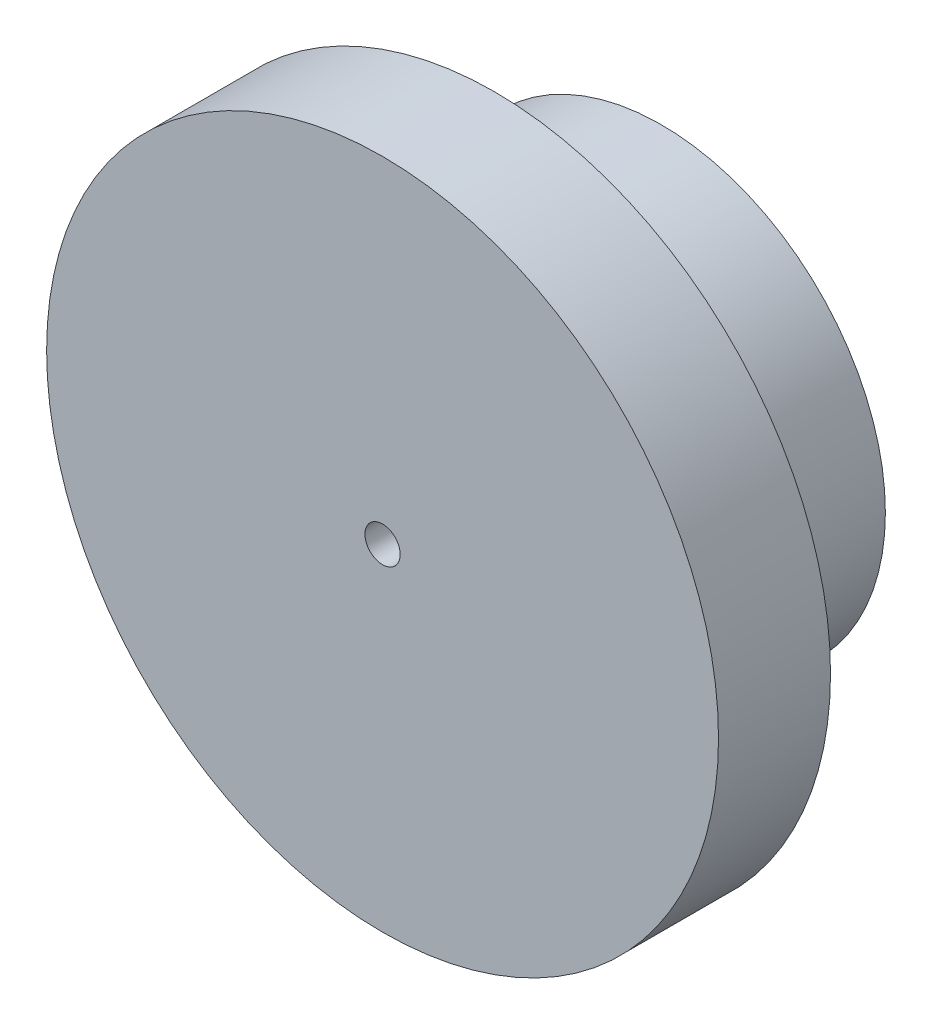
ISO-10303-21;
HEADER;
FILE_DESCRIPTION(('STEP AP214'),'2;1');
FILE_NAME('part.step','',(''),(''),'','','');
FILE_SCHEMA(('AUTOMOTIVE_DESIGN { 1 0 10303 214 1 1 1 1 }'));
ENDSEC;
DATA;
#1=APPLICATION_CONTEXT('core data for automotive mechanical design processes');
#2=APPLICATION_PROTOCOL_DEFINITION('international standard','automotive_design',2000,#1);
#3=PRODUCT_CONTEXT('',#1,'mechanical');
#4=PRODUCT('Part','Part','',(#3));
#5=PRODUCT_RELATED_PRODUCT_CATEGORY('part','',(#4));
#6=PRODUCT_DEFINITION_FORMATION('','',#4);
#7=PRODUCT_DEFINITION_CONTEXT('part definition',#1,'design');
#8=PRODUCT_DEFINITION('design','',#6,#7);
#9=PRODUCT_DEFINITION_SHAPE('','',#8);
#10=(LENGTH_UNIT() NAMED_UNIT(*) SI_UNIT(.MILLI.,.METRE.));
#11=(NAMED_UNIT(*) PLANE_ANGLE_UNIT() SI_UNIT($,.RADIAN.));
#12=(NAMED_UNIT(*) SI_UNIT($,.STERADIAN.) SOLID_ANGLE_UNIT());
#13=UNCERTAINTY_MEASURE_WITH_UNIT(LENGTH_MEASURE(1.E-05),#10,'distance_accuracy_value','');
#14=(GEOMETRIC_REPRESENTATION_CONTEXT(3) GLOBAL_UNCERTAINTY_ASSIGNED_CONTEXT((#13)) GLOBAL_UNIT_ASSIGNED_CONTEXT((#10,
#11,#12)) REPRESENTATION_CONTEXT('',''));
#15=CARTESIAN_POINT('',(0.,0.,0.));
#16=DIRECTION('',(0.,0.,1.));
#17=DIRECTION('',(1.,0.,0.));
#18=AXIS2_PLACEMENT_3D('',#15,#16,#17);
#19=CARTESIAN_POINT('',(0.,0.,-3.11150000000002));
#20=DIRECTION('',(0.,0.,1.));
#21=DIRECTION('',(1.,0.,0.));
#22=AXIS2_PLACEMENT_3D('',#19,#20,#21);
#23=CYLINDRICAL_SURFACE('',#22,12.7);
#24=CARTESIAN_POINT('',(0.,0.,-3.11150000000002));
#25=DIRECTION('',(0.,0.,1.));
#26=DIRECTION('',(1.,0.,0.));
#27=AXIS2_PLACEMENT_3D('',#24,#25,#26);
#28=CIRCLE('',#27,12.7);
#29=CARTESIAN_POINT('',(12.7,0.,-3.11150000000002));
#30=VERTEX_POINT('',#29);
#31=EDGE_CURVE('E10',#30,#30,#28,.T.);
#32=ORIENTED_EDGE('',*,*,#31,.T.);
#33=EDGE_LOOP('',(#32));
#34=FACE_BOUND('',#33,.T.);
#35=CARTESIAN_POINT('',(0.,0.,6.35));
#36=DIRECTION('',(0.,0.,1.));
#37=DIRECTION('',(1.,0.,0.));
#38=AXIS2_PLACEMENT_3D('',#35,#36,#37);
#39=CIRCLE('',#38,12.7);
#40=CARTESIAN_POINT('',(12.7,0.,6.35));
#41=VERTEX_POINT('',#40);
#42=EDGE_CURVE('E38',#41,#41,#39,.T.);
#43=ORIENTED_EDGE('',*,*,#42,.F.);
#44=EDGE_LOOP('',(#43));
#45=FACE_BOUND('',#44,.T.);
#46=ADVANCED_FACE('F32',(#34,#45),#23,.T.);
#47=CARTESIAN_POINT('',(0.,0.,-3.11150000000002));
#48=DIRECTION('',(0.,0.,1.));
#49=DIRECTION('',(1.,0.,0.));
#50=AXIS2_PLACEMENT_3D('',#47,#48,#49);
#51=PLANE('',#50);
#52=CARTESIAN_POINT('',(0.,0.,-3.11150000000002));
#53=DIRECTION('',(0.,0.,-1.));
#54=DIRECTION('',(-1.,0.,0.));
#55=AXIS2_PLACEMENT_3D('',#52,#53,#54);
#56=CIRCLE('',#55,11.);
#57=CARTESIAN_POINT('',(-11.,0.,-3.11150000000002));
#58=VERTEX_POINT('',#57);
#59=EDGE_CURVE('E58',#58,#58,#56,.T.);
#60=ORIENTED_EDGE('',*,*,#59,.F.);
#61=EDGE_LOOP('',(#60));
#62=FACE_BOUND('',#61,.T.);
#63=ORIENTED_EDGE('',*,*,#31,.F.);
#64=EDGE_LOOP('',(#63));
#65=FACE_BOUND('',#64,.T.);
#66=ADVANCED_FACE('F73',(#62,#65),#51,.F.);
#67=CARTESIAN_POINT('',(0.,0.,6.35));
#68=DIRECTION('',(0.,0.,1.));
#69=DIRECTION('',(1.,0.,0.));
#70=AXIS2_PLACEMENT_3D('',#67,#68,#69);
#71=PLANE('',#70);
#72=CARTESIAN_POINT('',(0.,0.,6.35));
#73=DIRECTION('',(0.,0.,1.));
#74=DIRECTION('',(1.,0.,0.));
#75=AXIS2_PLACEMENT_3D('',#72,#73,#74);
#76=CIRCLE('',#75,19.05);
#77=CARTESIAN_POINT('',(19.05,0.,6.35));
#78=VERTEX_POINT('',#77);
#79=EDGE_CURVE('E46',#78,#78,#76,.T.);
#80=ORIENTED_EDGE('',*,*,#79,.F.);
#81=EDGE_LOOP('',(#80));
#82=FACE_BOUND('',#81,.T.);
#83=ORIENTED_EDGE('',*,*,#42,.T.);
#84=EDGE_LOOP('',(#83));
#85=FACE_BOUND('',#84,.T.);
#86=ADVANCED_FACE('F76',(#82,#85),#71,.F.);
#87=CARTESIAN_POINT('',(0.,0.,12.7));
#88=DIRECTION('',(0.,0.,1.));
#89=DIRECTION('',(1.,0.,0.));
#90=AXIS2_PLACEMENT_3D('',#87,#88,#89);
#91=PLANE('',#90);
#92=CARTESIAN_POINT('',(0.,0.,12.7));
#93=DIRECTION('',(0.,0.,1.));
#94=DIRECTION('',(1.,0.,0.));
#95=AXIS2_PLACEMENT_3D('',#92,#93,#94);
#96=CIRCLE('',#95,19.05);
#97=CARTESIAN_POINT('',(19.05,0.,12.7));
#98=VERTEX_POINT('',#97);
#99=EDGE_CURVE('E42',#98,#98,#96,.T.);
#100=ORIENTED_EDGE('',*,*,#99,.T.);
#101=EDGE_LOOP('',(#100));
#102=FACE_BOUND('',#101,.T.);
#103=CARTESIAN_POINT('',(0.,0.,12.7));
#104=DIRECTION('',(0.,0.,1.));
#105=DIRECTION('',(1.,0.,0.));
#106=AXIS2_PLACEMENT_3D('',#103,#104,#105);
#107=CIRCLE('',#106,1.);
#108=CARTESIAN_POINT('',(1.,0.,12.7));
#109=VERTEX_POINT('',#108);
#110=EDGE_CURVE('E50',#109,#109,#107,.T.);
#111=ORIENTED_EDGE('',*,*,#110,.F.);
#112=EDGE_LOOP('',(#111));
#113=FACE_BOUND('',#112,.T.);
#114=ADVANCED_FACE('F81',(#102,#113),#91,.T.);
#115=CARTESIAN_POINT('',(0.,0.,12.7));
#116=DIRECTION('',(0.,0.,-1.));
#117=DIRECTION('',(-1.,0.,0.));
#118=AXIS2_PLACEMENT_3D('',#115,#116,#117);
#119=CYLINDRICAL_SURFACE('',#118,19.05);
#120=ORIENTED_EDGE('',*,*,#99,.F.);
#121=EDGE_LOOP('',(#120));
#122=FACE_BOUND('',#121,.T.);
#123=ORIENTED_EDGE('',*,*,#79,.T.);
#124=EDGE_LOOP('',(#123));
#125=FACE_BOUND('',#124,.T.);
#126=ADVANCED_FACE('F89',(#122,#125),#119,.T.);
#127=CARTESIAN_POINT('',(0.,0.,12.7));
#128=DIRECTION('',(0.,0.,-1.));
#129=DIRECTION('',(-1.,0.,0.));
#130=AXIS2_PLACEMENT_3D('',#127,#128,#129);
#131=CYLINDRICAL_SURFACE('',#130,1.);
#132=ORIENTED_EDGE('',*,*,#110,.T.);
#133=EDGE_LOOP('',(#132));
#134=FACE_BOUND('',#133,.T.);
#135=CARTESIAN_POINT('',(0.,0.,6.35));
#136=DIRECTION('',(0.,0.,1.));
#137=DIRECTION('',(1.,0.,0.));
#138=AXIS2_PLACEMENT_3D('',#135,#136,#137);
#139=CIRCLE('',#138,1.);
#140=CARTESIAN_POINT('',(1.,0.,6.35));
#141=VERTEX_POINT('',#140);
#142=EDGE_CURVE('E52',#141,#141,#139,.T.);
#143=ORIENTED_EDGE('',*,*,#142,.F.);
#144=EDGE_LOOP('',(#143));
#145=FACE_BOUND('',#144,.T.);
#146=ADVANCED_FACE('F87',(#134,#145),#131,.F.);
#147=CARTESIAN_POINT('',(0.,0.,6.35));
#148=DIRECTION('',(0.,0.,1.));
#149=DIRECTION('',(1.,0.,0.));
#150=AXIS2_PLACEMENT_3D('',#147,#148,#149);
#151=PLANE('',#150);
#152=ORIENTED_EDGE('',*,*,#142,.T.);
#153=EDGE_LOOP('',(#152));
#154=FACE_BOUND('',#153,.T.);
#155=ADVANCED_FACE('F69',(#154),#151,.T.);
#156=CARTESIAN_POINT('',(0.,0.,3.88849999999998));
#157=DIRECTION('',(0.,0.,-1.));
#158=DIRECTION('',(-1.,0.,0.));
#159=AXIS2_PLACEMENT_3D('',#156,#157,#158);
#160=CYLINDRICAL_SURFACE('',#159,11.);
#161=CARTESIAN_POINT('',(0.,0.,3.88849999999998));
#162=DIRECTION('',(0.,0.,-1.));
#163=DIRECTION('',(-1.,0.,0.));
#164=AXIS2_PLACEMENT_3D('',#161,#162,#163);
#165=CIRCLE('',#164,11.);
#166=CARTESIAN_POINT('',(-11.,0.,3.88849999999998));
#167=VERTEX_POINT('',#166);
#168=EDGE_CURVE('E55',#167,#167,#165,.T.);
#169=ORIENTED_EDGE('',*,*,#168,.F.);
#170=EDGE_LOOP('',(#169));
#171=FACE_BOUND('',#170,.T.);
#172=ORIENTED_EDGE('',*,*,#59,.T.);
#173=EDGE_LOOP('',(#172));
#174=FACE_BOUND('',#173,.T.);
#175=ADVANCED_FACE('F66',(#171,#174),#160,.F.);
#176=CARTESIAN_POINT('',(0.,0.,3.88849999999998));
#177=DIRECTION('',(0.,0.,-1.));
#178=DIRECTION('',(-1.,0.,0.));
#179=AXIS2_PLACEMENT_3D('',#176,#177,#178);
#180=PLANE('',#179);
#181=ORIENTED_EDGE('',*,*,#168,.T.);
#182=EDGE_LOOP('',(#181));
#183=FACE_BOUND('',#182,.T.);
#184=ADVANCED_FACE('F64',(#183),#180,.T.);
#185=CLOSED_SHELL('',(#46,#66,#86,#114,#126,#146,#155,#175,#184));
#186=MANIFOLD_SOLID_BREP('B2',#185);
#187=ADVANCED_BREP_SHAPE_REPRESENTATION('',(#18,#186),#14);
#188=SHAPE_DEFINITION_REPRESENTATION(#9,#187);
ENDSEC;
END-ISO-10303-21;
